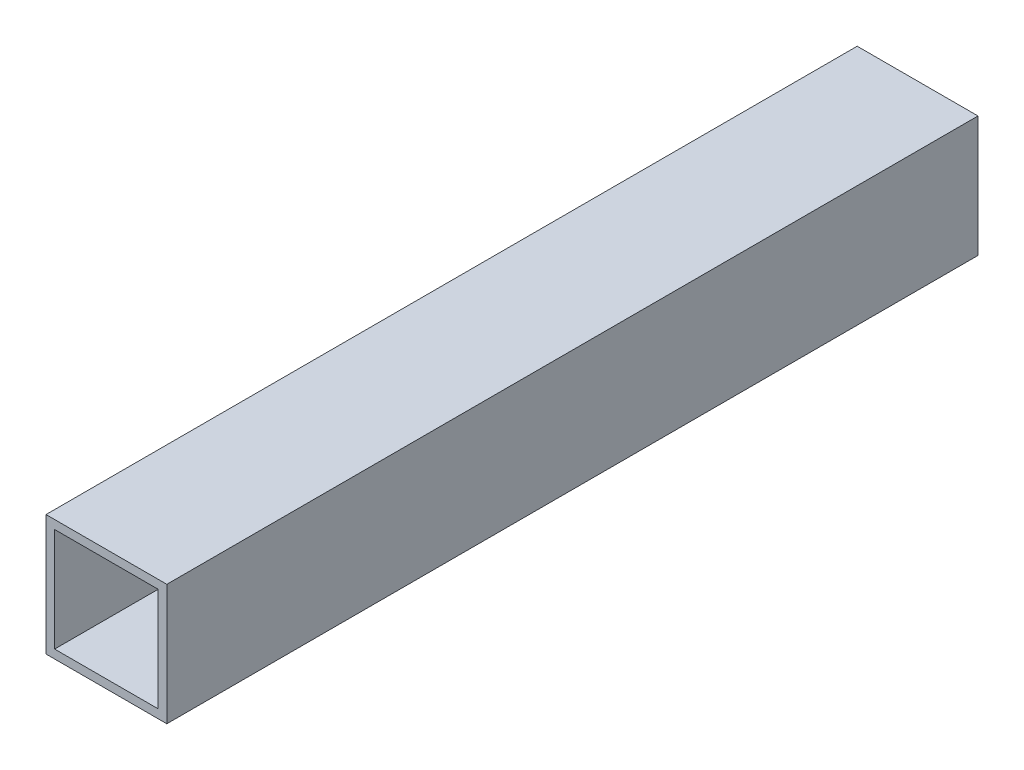
ISO-10303-21;
HEADER;
FILE_DESCRIPTION(('STEP AP214'),'2;1');
FILE_NAME('part.step','',(''),(''),'','','');
FILE_SCHEMA(('AUTOMOTIVE_DESIGN { 1 0 10303 214 1 1 1 1 }'));
ENDSEC;
DATA;
#1=APPLICATION_CONTEXT('core data for automotive mechanical design processes');
#2=APPLICATION_PROTOCOL_DEFINITION('international standard','automotive_design',2000,#1);
#3=PRODUCT_CONTEXT('',#1,'mechanical');
#4=PRODUCT('Part','Part','',(#3));
#5=PRODUCT_RELATED_PRODUCT_CATEGORY('part','',(#4));
#6=PRODUCT_DEFINITION_FORMATION('','',#4);
#7=PRODUCT_DEFINITION_CONTEXT('part definition',#1,'design');
#8=PRODUCT_DEFINITION('design','',#6,#7);
#9=PRODUCT_DEFINITION_SHAPE('','',#8);
#10=(LENGTH_UNIT() NAMED_UNIT(*) SI_UNIT(.MILLI.,.METRE.));
#11=(NAMED_UNIT(*) PLANE_ANGLE_UNIT() SI_UNIT($,.RADIAN.));
#12=(NAMED_UNIT(*) SI_UNIT($,.STERADIAN.) SOLID_ANGLE_UNIT());
#13=UNCERTAINTY_MEASURE_WITH_UNIT(LENGTH_MEASURE(1.E-05),#10,'distance_accuracy_value','');
#14=(GEOMETRIC_REPRESENTATION_CONTEXT(3) GLOBAL_UNCERTAINTY_ASSIGNED_CONTEXT((#13)) GLOBAL_UNIT_ASSIGNED_CONTEXT((#10,
#11,#12)) REPRESENTATION_CONTEXT('',''));
#15=CARTESIAN_POINT('',(0.,0.,0.));
#16=DIRECTION('',(0.,0.,1.));
#17=DIRECTION('',(1.,0.,0.));
#18=AXIS2_PLACEMENT_3D('',#15,#16,#17);
#19=CARTESIAN_POINT('',(-546.099999999999,330.199999999991,-298.449999999997));
#20=DIRECTION('',(0.,-0.999999999999982,0.));
#21=DIRECTION('',(0.,0.,-0.99999999999999));
#22=AXIS2_PLACEMENT_3D('',#19,#20,#21);
#23=PLANE('',#22);
#24=DIRECTION('',(-0.999999999999998,0.,0.));
#25=VECTOR('',#24,1.);
#26=CARTESIAN_POINT('',(-22.2250000000024,330.199999999991,-298.449999999996));
#27=LINE('',#26,#25);
#28=CARTESIAN_POINT('',(-523.874999999997,330.199999999991,-298.449999999996));
#29=VERTEX_POINT('',#28);
#30=CARTESIAN_POINT('',(-561.974999999997,330.199999999991,-298.449999999997));
#31=VERTEX_POINT('',#30);
#32=EDGE_CURVE('E120',#29,#31,#27,.T.);
#33=ORIENTED_EDGE('',*,*,#32,.F.);
#34=DIRECTION('',(0.,0.,-0.99999999999999));
#35=VECTOR('',#34,1.);
#36=CARTESIAN_POINT('',(-523.874999999997,330.199999999991,-298.449999999996));
#37=LINE('',#36,#35);
#38=CARTESIAN_POINT('',(-523.874999999999,330.199999999991,-1.55431223447522E-12));
#39=VERTEX_POINT('',#38);
#40=EDGE_CURVE('E88',#29,#39,#37,.F.);
#41=ORIENTED_EDGE('',*,*,#40,.T.);
#42=DIRECTION('',(-0.999999999999998,0.,0.));
#43=VECTOR('',#42,1.);
#44=CARTESIAN_POINT('',(-22.2250000000025,330.19999999999,-9.43689570931383E-13));
#45=LINE('',#44,#43);
#46=CARTESIAN_POINT('',(-561.974999999999,330.199999999991,-1.27675647831893E-12));
#47=VERTEX_POINT('',#46);
#48=EDGE_CURVE('E102',#39,#47,#45,.T.);
#49=ORIENTED_EDGE('',*,*,#48,.T.);
#50=DIRECTION('',(0.,0.,-0.99999999999999));
#51=VECTOR('',#50,1.);
#52=CARTESIAN_POINT('',(-561.974999999997,330.199999999991,-298.449999999997));
#53=LINE('',#52,#51);
#54=EDGE_CURVE('E17',#31,#47,#53,.F.);
#55=ORIENTED_EDGE('',*,*,#54,.F.);
#56=EDGE_LOOP('',(#33,#41,#49,#55));
#57=FACE_BOUND('',#56,.T.);
#58=ADVANCED_FACE('F14',(#57),#23,.T.);
#59=CARTESIAN_POINT('',(-561.974999999997,317.499999999991,-298.449999999997));
#60=DIRECTION('',(0.999999999999998,0.,0.));
#61=DIRECTION('',(0.,0.,-0.99999999999999));
#62=AXIS2_PLACEMENT_3D('',#59,#60,#61);
#63=PLANE('',#62);
#64=DIRECTION('',(0.,0.999999999999982,0.));
#65=VECTOR('',#64,1.);
#66=CARTESIAN_POINT('',(-561.974999999997,155.574999999996,-298.449999999997));
#67=LINE('',#66,#65);
#68=CARTESIAN_POINT('',(-561.974999999999,292.099999999992,-298.449999999997));
#69=VERTEX_POINT('',#68);
#70=EDGE_CURVE('E118',#31,#69,#67,.F.);
#71=ORIENTED_EDGE('',*,*,#70,.F.);
#72=ORIENTED_EDGE('',*,*,#54,.T.);
#73=DIRECTION('',(0.,0.999999999999982,0.));
#74=VECTOR('',#73,1.);
#75=CARTESIAN_POINT('',(-561.974999999999,155.574999999996,0.));
#76=LINE('',#75,#74);
#77=CARTESIAN_POINT('',(-561.974999999999,292.099999999992,-7.21644966006352E-13));
#78=VERTEX_POINT('',#77);
#79=EDGE_CURVE('E79',#47,#78,#76,.F.);
#80=ORIENTED_EDGE('',*,*,#79,.T.);
#81=DIRECTION('',(0.,0.,-0.99999999999999));
#82=VECTOR('',#81,1.);
#83=CARTESIAN_POINT('',(-561.974999999999,292.099999999992,-298.449999999997));
#84=LINE('',#83,#82);
#85=EDGE_CURVE('E82',#78,#69,#84,.T.);
#86=ORIENTED_EDGE('',*,*,#85,.T.);
#87=EDGE_LOOP('',(#71,#72,#80,#86));
#88=FACE_BOUND('',#87,.T.);
#89=ADVANCED_FACE('F81',(#88),#63,.T.);
#90=CARTESIAN_POINT('',(-546.099999999999,292.099999999992,-298.449999999997));
#91=DIRECTION('',(0.,-0.999999999999982,0.));
#92=DIRECTION('',(0.,0.,-0.99999999999999));
#93=AXIS2_PLACEMENT_3D('',#90,#91,#92);
#94=PLANE('',#93);
#95=DIRECTION('',(0.,0.,-0.99999999999999));
#96=VECTOR('',#95,1.);
#97=CARTESIAN_POINT('',(-523.874999999999,292.099999999991,-298.449999999996));
#98=LINE('',#97,#96);
#99=CARTESIAN_POINT('',(-523.875,292.099999999991,-9.99200722162641E-13));
#100=VERTEX_POINT('',#99);
#101=CARTESIAN_POINT('',(-523.874999999999,292.099999999991,-298.449999999996));
#102=VERTEX_POINT('',#101);
#103=EDGE_CURVE('E96',#100,#102,#98,.T.);
#104=ORIENTED_EDGE('',*,*,#103,.T.);
#105=DIRECTION('',(-0.999999999999998,0.,0.));
#106=VECTOR('',#105,1.);
#107=CARTESIAN_POINT('',(-22.2250000000024,292.099999999991,-298.449999999996));
#108=LINE('',#107,#106);
#109=EDGE_CURVE('E94',#69,#102,#108,.F.);
#110=ORIENTED_EDGE('',*,*,#109,.F.);
#111=ORIENTED_EDGE('',*,*,#85,.F.);
#112=DIRECTION('',(-0.999999999999998,0.,0.));
#113=VECTOR('',#112,1.);
#114=CARTESIAN_POINT('',(-22.2250000000036,292.09999999999,-5.55111512312578E-13));
#115=LINE('',#114,#113);
#116=EDGE_CURVE('E87',#78,#100,#115,.F.);
#117=ORIENTED_EDGE('',*,*,#116,.T.);
#118=EDGE_LOOP('',(#104,#110,#111,#117));
#119=FACE_BOUND('',#118,.T.);
#120=ADVANCED_FACE('F91',(#119),#94,.F.);
#121=CARTESIAN_POINT('',(-523.874999999997,317.499999999991,-298.449999999996));
#122=DIRECTION('',(0.999999999999998,0.,0.));
#123=DIRECTION('',(0.,0.,-0.99999999999999));
#124=AXIS2_PLACEMENT_3D('',#121,#122,#123);
#125=PLANE('',#124);
#126=ORIENTED_EDGE('',*,*,#40,.F.);
#127=DIRECTION('',(0.,0.999999999999982,0.));
#128=VECTOR('',#127,1.);
#129=CARTESIAN_POINT('',(-523.875,155.574999999995,-298.449999999996));
#130=LINE('',#129,#128);
#131=EDGE_CURVE('E111',#102,#29,#130,.T.);
#132=ORIENTED_EDGE('',*,*,#131,.F.);
#133=ORIENTED_EDGE('',*,*,#103,.F.);
#134=DIRECTION('',(0.,0.999999999999982,0.));
#135=VECTOR('',#134,1.);
#136=CARTESIAN_POINT('',(-523.875,155.574999999995,-2.77555756156289E-13));
#137=LINE('',#136,#135);
#138=EDGE_CURVE('E100',#100,#39,#137,.T.);
#139=ORIENTED_EDGE('',*,*,#138,.T.);
#140=EDGE_LOOP('',(#126,#132,#133,#139));
#141=FACE_BOUND('',#140,.T.);
#142=ADVANCED_FACE('F112',(#141),#125,.F.);
#143=CARTESIAN_POINT('',(-536.254275512699,333.374999999991,-298.449999999995));
#144=DIRECTION('',(0.,-0.999999999999982,0.));
#145=DIRECTION('',(0.,0.,-0.99999999999999));
#146=AXIS2_PLACEMENT_3D('',#143,#144,#145);
#147=PLANE('',#146);
#148=DIRECTION('',(0.,0.,0.99999999999999));
#149=VECTOR('',#148,1.);
#150=CARTESIAN_POINT('',(-520.7,333.374999999991,-298.449999999995));
#151=LINE('',#150,#149);
#152=CARTESIAN_POINT('',(-520.699999999998,333.374999999991,-1.16573417585641E-12));
#153=VERTEX_POINT('',#152);
#154=CARTESIAN_POINT('',(-520.7,333.374999999991,-298.449999999995));
#155=VERTEX_POINT('',#154);
#156=EDGE_CURVE('E229',#153,#155,#151,.F.);
#157=ORIENTED_EDGE('',*,*,#156,.T.);
#158=DIRECTION('',(-0.999999999999998,0.,0.));
#159=VECTOR('',#158,1.);
#160=CARTESIAN_POINT('',(-22.2250000000024,333.374999999991,-298.449999999996));
#161=LINE('',#160,#159);
#162=CARTESIAN_POINT('',(-565.149999999999,333.374999999991,-298.449999999996));
#163=VERTEX_POINT('',#162);
#164=EDGE_CURVE('E230',#163,#155,#161,.F.);
#165=ORIENTED_EDGE('',*,*,#164,.F.);
#166=DIRECTION('',(0.,0.,-0.99999999999999));
#167=VECTOR('',#166,1.);
#168=CARTESIAN_POINT('',(-565.149999999999,333.374999999991,-298.449999999996));
#169=LINE('',#168,#167);
#170=CARTESIAN_POINT('',(-565.149999999999,333.374999999991,-7.21644966006352E-13));
#171=VERTEX_POINT('',#170);
#172=EDGE_CURVE('E127',#163,#171,#169,.F.);
#173=ORIENTED_EDGE('',*,*,#172,.T.);
#174=DIRECTION('',(-0.999999999999998,0.,0.));
#175=VECTOR('',#174,1.);
#176=CARTESIAN_POINT('',(-22.2250000000025,333.37499999999,-3.33066907387547E-13));
#177=LINE('',#176,#175);
#178=EDGE_CURVE('E129',#171,#153,#177,.F.);
#179=ORIENTED_EDGE('',*,*,#178,.T.);
#180=EDGE_LOOP('',(#157,#165,#173,#179));
#181=FACE_BOUND('',#180,.T.);
#182=ADVANCED_FACE('F156',(#181),#147,.F.);
#183=CARTESIAN_POINT('',(-22.2250000000023,155.574999999995,0.));
#184=DIRECTION('',(0.,0.,-0.99999999999999));
#185=DIRECTION('',(-0.999999999999998,0.,0.));
#186=AXIS2_PLACEMENT_3D('',#183,#184,#185);
#187=PLANE('',#186);
#188=DIRECTION('',(0.,0.999999999999982,0.));
#189=VECTOR('',#188,1.);
#190=CARTESIAN_POINT('',(-520.699999999998,315.421597504607,-1.0547118733939E-12));
#191=LINE('',#190,#189);
#192=CARTESIAN_POINT('',(-520.699999999998,288.924999999992,-2.33146835171283E-12));
#193=VERTEX_POINT('',#192);
#194=EDGE_CURVE('E237',#193,#153,#191,.T.);
#195=ORIENTED_EDGE('',*,*,#194,.T.);
#196=ORIENTED_EDGE('',*,*,#178,.F.);
#197=DIRECTION('',(0.,0.999999999999982,0.));
#198=VECTOR('',#197,1.);
#199=CARTESIAN_POINT('',(-565.149999999999,45.6223088562475,-1.33226762955019E-12));
#200=LINE('',#199,#198);
#201=CARTESIAN_POINT('',(-565.149999999999,288.924999999991,-2.05391259555654E-12));
#202=VERTEX_POINT('',#201);
#203=EDGE_CURVE('E125',#171,#202,#200,.F.);
#204=ORIENTED_EDGE('',*,*,#203,.T.);
#205=DIRECTION('',(0.999999999999998,0.,0.));
#206=VECTOR('',#205,1.);
#207=CARTESIAN_POINT('',(-536.254275512692,288.924999999992,-2.16493489801906E-12));
#208=LINE('',#207,#206);
#209=EDGE_CURVE('E239',#193,#202,#208,.F.);
#210=ORIENTED_EDGE('',*,*,#209,.F.);
#211=EDGE_LOOP('',(#195,#196,#204,#210));
#212=FACE_BOUND('',#211,.T.);
#213=ORIENTED_EDGE('',*,*,#138,.F.);
#214=ORIENTED_EDGE('',*,*,#116,.F.);
#215=ORIENTED_EDGE('',*,*,#79,.F.);
#216=ORIENTED_EDGE('',*,*,#48,.F.);
#217=EDGE_LOOP('',(#213,#214,#215,#216));
#218=FACE_BOUND('',#217,.T.);
#219=ADVANCED_FACE('F98',(#212,#218),#187,.F.);
#220=CARTESIAN_POINT('',(-565.149999999999,45.6223088562476,-298.449999999998));
#221=DIRECTION('',(0.999999999999998,0.,0.));
#222=DIRECTION('',(0.,0.,-0.99999999999999));
#223=AXIS2_PLACEMENT_3D('',#220,#221,#222);
#224=PLANE('',#223);
#225=ORIENTED_EDGE('',*,*,#172,.F.);
#226=DIRECTION('',(0.,0.999999999999982,0.));
#227=VECTOR('',#226,1.);
#228=CARTESIAN_POINT('',(-565.149999999999,155.574999999996,-298.449999999997));
#229=LINE('',#228,#227);
#230=CARTESIAN_POINT('',(-565.149999999999,288.924999999991,-298.449999999999));
#231=VERTEX_POINT('',#230);
#232=EDGE_CURVE('E115',#231,#163,#229,.T.);
#233=ORIENTED_EDGE('',*,*,#232,.F.);
#234=DIRECTION('',(0.,0.,-0.99999999999999));
#235=VECTOR('',#234,1.);
#236=CARTESIAN_POINT('',(-565.149999999999,288.924999999991,-298.449999999999));
#237=LINE('',#236,#235);
#238=EDGE_CURVE('E244',#202,#231,#237,.T.);
#239=ORIENTED_EDGE('',*,*,#238,.F.);
#240=ORIENTED_EDGE('',*,*,#203,.F.);
#241=EDGE_LOOP('',(#225,#233,#239,#240));
#242=FACE_BOUND('',#241,.T.);
#243=ADVANCED_FACE('F150',(#242),#224,.F.);
#244=CARTESIAN_POINT('',(-22.225000000001,155.574999999995,-298.449999999996));
#245=DIRECTION('',(0.,0.,-0.99999999999999));
#246=DIRECTION('',(-0.999999999999998,0.,0.));
#247=AXIS2_PLACEMENT_3D('',#244,#245,#246);
#248=PLANE('',#247);
#249=ORIENTED_EDGE('',*,*,#164,.T.);
#250=DIRECTION('',(0.,0.999999999999982,0.));
#251=VECTOR('',#250,1.);
#252=CARTESIAN_POINT('',(-520.7,315.421597504607,-298.449999999995));
#253=LINE('',#252,#251);
#254=CARTESIAN_POINT('',(-520.7,288.924999999992,-298.449999999998));
#255=VERTEX_POINT('',#254);
#256=EDGE_CURVE('E32',#155,#255,#253,.F.);
#257=ORIENTED_EDGE('',*,*,#256,.T.);
#258=DIRECTION('',(0.999999999999998,0.,0.));
#259=VECTOR('',#258,1.);
#260=CARTESIAN_POINT('',(-536.254275512699,288.924999999992,-298.449999999998));
#261=LINE('',#260,#259);
#262=EDGE_CURVE('E23',#231,#255,#261,.T.);
#263=ORIENTED_EDGE('',*,*,#262,.F.);
#264=ORIENTED_EDGE('',*,*,#232,.T.);
#265=EDGE_LOOP('',(#249,#257,#263,#264));
#266=FACE_BOUND('',#265,.T.);
#267=ORIENTED_EDGE('',*,*,#109,.T.);
#268=ORIENTED_EDGE('',*,*,#131,.T.);
#269=ORIENTED_EDGE('',*,*,#32,.T.);
#270=ORIENTED_EDGE('',*,*,#70,.T.);
#271=EDGE_LOOP('',(#267,#268,#269,#270));
#272=FACE_BOUND('',#271,.T.);
#273=ADVANCED_FACE('F117',(#266,#272),#248,.T.);
#274=CARTESIAN_POINT('',(-520.7,315.421597504607,-298.449999999995));
#275=DIRECTION('',(-0.999999999999998,0.,0.));
#276=DIRECTION('',(0.,0.,0.99999999999999));
#277=AXIS2_PLACEMENT_3D('',#274,#275,#276);
#278=PLANE('',#277);
#279=DIRECTION('',(0.,0.,-0.99999999999999));
#280=VECTOR('',#279,1.);
#281=CARTESIAN_POINT('',(-520.7,288.924999999992,-298.449999999998));
#282=LINE('',#281,#280);
#283=EDGE_CURVE('E9',#255,#193,#282,.F.);
#284=ORIENTED_EDGE('',*,*,#283,.F.);
#285=ORIENTED_EDGE('',*,*,#256,.F.);
#286=ORIENTED_EDGE('',*,*,#156,.F.);
#287=ORIENTED_EDGE('',*,*,#194,.F.);
#288=EDGE_LOOP('',(#284,#285,#286,#287));
#289=FACE_BOUND('',#288,.T.);
#290=ADVANCED_FACE('F138',(#289),#278,.F.);
#291=CARTESIAN_POINT('',(-536.254275512699,288.924999999992,-298.449999999998));
#292=DIRECTION('',(0.,-0.999999999999982,0.));
#293=DIRECTION('',(0.,0.,-0.99999999999999));
#294=AXIS2_PLACEMENT_3D('',#291,#292,#293);
#295=PLANE('',#294);
#296=ORIENTED_EDGE('',*,*,#262,.T.);
#297=ORIENTED_EDGE('',*,*,#283,.T.);
#298=ORIENTED_EDGE('',*,*,#209,.T.);
#299=ORIENTED_EDGE('',*,*,#238,.T.);
#300=EDGE_LOOP('',(#296,#297,#298,#299));
#301=FACE_BOUND('',#300,.T.);
#302=ADVANCED_FACE('F136',(#301),#295,.T.);
#303=CLOSED_SHELL('',(#58,#89,#120,#142,#182,#219,#243,#273,#290,#302));
#304=MANIFOLD_SOLID_BREP('B1',#303);
#305=ADVANCED_BREP_SHAPE_REPRESENTATION('',(#18,#304),#14);
#306=SHAPE_DEFINITION_REPRESENTATION(#9,#305);
ENDSEC;
END-ISO-10303-21;
